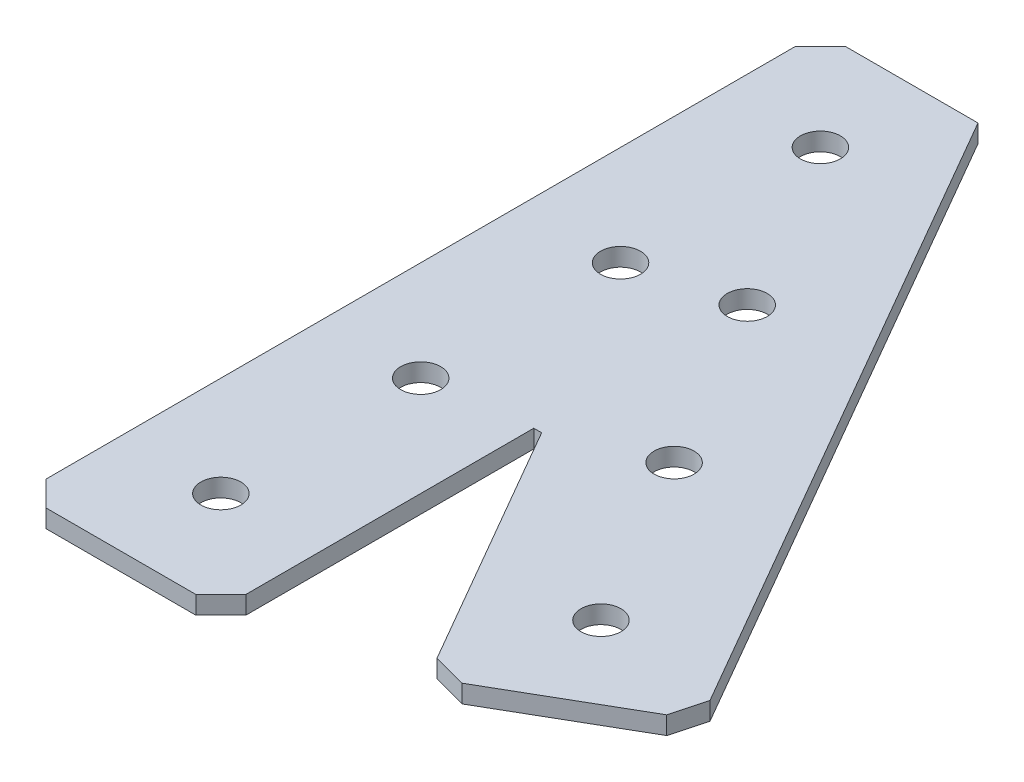
ISO-10303-21;
HEADER;
FILE_DESCRIPTION(('STEP AP214'),'2;1');
FILE_NAME('part.step','',(''),(''),'','','');
FILE_SCHEMA(('AUTOMOTIVE_DESIGN { 1 0 10303 214 1 1 1 1 }'));
ENDSEC;
DATA;
#1=APPLICATION_CONTEXT('core data for automotive mechanical design processes');
#2=APPLICATION_PROTOCOL_DEFINITION('international standard','automotive_design',2000,#1);
#3=PRODUCT_CONTEXT('',#1,'mechanical');
#4=PRODUCT('Part','Part','',(#3));
#5=PRODUCT_RELATED_PRODUCT_CATEGORY('part','',(#4));
#6=PRODUCT_DEFINITION_FORMATION('','',#4);
#7=PRODUCT_DEFINITION_CONTEXT('part definition',#1,'design');
#8=PRODUCT_DEFINITION('design','',#6,#7);
#9=PRODUCT_DEFINITION_SHAPE('','',#8);
#10=(LENGTH_UNIT() NAMED_UNIT(*) SI_UNIT(.MILLI.,.METRE.));
#11=(NAMED_UNIT(*) PLANE_ANGLE_UNIT() SI_UNIT($,.RADIAN.));
#12=(NAMED_UNIT(*) SI_UNIT($,.STERADIAN.) SOLID_ANGLE_UNIT());
#13=UNCERTAINTY_MEASURE_WITH_UNIT(LENGTH_MEASURE(1.E-05),#10,'distance_accuracy_value','');
#14=(GEOMETRIC_REPRESENTATION_CONTEXT(3) GLOBAL_UNCERTAINTY_ASSIGNED_CONTEXT((#13)) GLOBAL_UNIT_ASSIGNED_CONTEXT((#10,
#11,#12)) REPRESENTATION_CONTEXT('',''));
#15=CARTESIAN_POINT('',(0.,0.,0.));
#16=DIRECTION('',(0.,0.,1.));
#17=DIRECTION('',(1.,0.,0.));
#18=AXIS2_PLACEMENT_3D('',#15,#16,#17);
#19=CARTESIAN_POINT('',(13.7,2.286,49.1290960636936));
#20=DIRECTION('',(0.,0.,1.));
#21=DIRECTION('',(1.,0.,0.));
#22=AXIS2_PLACEMENT_3D('',#19,#20,#21);
#23=PLANE('',#22);
#24=DIRECTION('',(1.,0.,0.));
#25=VECTOR('',#24,1.);
#26=CARTESIAN_POINT('',(13.7,2.286,49.1290960636936));
#27=LINE('',#26,#25);
#28=CARTESIAN_POINT('',(13.7,2.286,49.1290960636936));
#29=VERTEX_POINT('',#28);
#30=CARTESIAN_POINT('',(12.7,2.286,49.1290960636936));
#31=VERTEX_POINT('',#30);
#32=EDGE_CURVE('E145',#29,#31,#27,.F.);
#33=ORIENTED_EDGE('',*,*,#32,.T.);
#34=DIRECTION('',(0.,1.,0.));
#35=VECTOR('',#34,1.);
#36=CARTESIAN_POINT('',(12.7,2.286,49.1290960636936));
#37=LINE('',#36,#35);
#38=CARTESIAN_POINT('',(12.7,0.,49.1290960636936));
#39=VERTEX_POINT('',#38);
#40=EDGE_CURVE('E423',#39,#31,#37,.T.);
#41=ORIENTED_EDGE('',*,*,#40,.F.);
#42=DIRECTION('',(1.,0.,0.));
#43=VECTOR('',#42,1.);
#44=CARTESIAN_POINT('',(0.,0.,49.1290960636936));
#45=LINE('',#44,#43);
#46=CARTESIAN_POINT('',(13.7,0.,49.1290960636936));
#47=VERTEX_POINT('',#46);
#48=EDGE_CURVE('E109',#47,#39,#45,.F.);
#49=ORIENTED_EDGE('',*,*,#48,.F.);
#50=DIRECTION('',(0.,1.,0.));
#51=VECTOR('',#50,1.);
#52=CARTESIAN_POINT('',(13.7,2.286,49.1290960636936));
#53=LINE('',#52,#51);
#54=EDGE_CURVE('E121',#29,#47,#53,.F.);
#55=ORIENTED_EDGE('',*,*,#54,.F.);
#56=EDGE_LOOP('',(#33,#41,#49,#55));
#57=FACE_BOUND('',#56,.T.);
#58=ADVANCED_FACE('F18',(#57),#23,.T.);
#59=CARTESIAN_POINT('',(0.,0.,0.));
#60=DIRECTION('',(0.,-1.,0.));
#61=DIRECTION('',(0.,0.,-1.));
#62=AXIS2_PLACEMENT_3D('',#59,#60,#61);
#63=PLANE('',#62);
#64=DIRECTION('',(-0.500000000000001,0.,-0.866025403784438));
#65=VECTOR('',#64,1.);
#66=CARTESIAN_POINT('',(7.33234841870835,0.,-12.7));
#67=LINE('',#66,#65);
#68=CARTESIAN_POINT('',(53.8610226280625,0.,67.8900277394209));
#69=VERTEX_POINT('',#68);
#70=CARTESIAN_POINT('',(7.33234841870834,0.,-12.7));
#71=VERTEX_POINT('',#70);
#72=EDGE_CURVE('E453',#69,#71,#67,.T.);
#73=ORIENTED_EDGE('',*,*,#72,.F.);
#74=DIRECTION('',(0.258819045102514,0.,-0.96592582628907));
#75=VECTOR('',#74,1.);
#76=CARTESIAN_POINT('',(53.8610226280625,0.,67.8900277394209));
#77=LINE('',#76,#75);
#78=CARTESIAN_POINT('',(52.6988919710469,0.,72.2271583964365));
#79=VERTEX_POINT('',#78);
#80=EDGE_CURVE('E449',#79,#69,#77,.T.);
#81=ORIENTED_EDGE('',*,*,#80,.F.);
#82=DIRECTION('',(0.866025403784438,0.,-0.500000000000001));
#83=VECTOR('',#82,1.);
#84=CARTESIAN_POINT('',(52.6988919710469,0.,72.2271583964365));
#85=LINE('',#84,#83);
#86=CARTESIAN_POINT('',(36.2011080289534,0.,81.7521583964365));
#87=VERTEX_POINT('',#86);
#88=EDGE_CURVE('E130',#87,#79,#85,.T.);
#89=ORIENTED_EDGE('',*,*,#88,.F.);
#90=DIRECTION('',(0.965925826289068,0.,0.258819045102521));
#91=VECTOR('',#90,1.);
#92=CARTESIAN_POINT('',(36.2011080289534,0.,81.7521583964365));
#93=LINE('',#92,#91);
#94=CARTESIAN_POINT('',(31.8639773719377,0.,80.5900277394209));
#95=VERTEX_POINT('',#94);
#96=EDGE_CURVE('E123',#95,#87,#93,.T.);
#97=ORIENTED_EDGE('',*,*,#96,.F.);
#98=DIRECTION('',(0.500000000000001,0.,0.866025403784438));
#99=VECTOR('',#98,1.);
#100=CARTESIAN_POINT('',(31.8639773719377,0.,80.5900277394209));
#101=LINE('',#100,#99);
#102=EDGE_CURVE('E114',#47,#95,#101,.T.);
#103=ORIENTED_EDGE('',*,*,#102,.F.);
#104=ORIENTED_EDGE('',*,*,#48,.T.);
#105=DIRECTION('',(0.,0.,-1.));
#106=VECTOR('',#105,1.);
#107=CARTESIAN_POINT('',(12.7,0.,49.1290960636936));
#108=LINE('',#107,#106);
#109=CARTESIAN_POINT('',(12.7,0.,85.725));
#110=VERTEX_POINT('',#109);
#111=EDGE_CURVE('E140',#110,#39,#108,.T.);
#112=ORIENTED_EDGE('',*,*,#111,.F.);
#113=DIRECTION('',(0.707106781186545,0.,-0.70710678118655));
#114=VECTOR('',#113,1.);
#115=CARTESIAN_POINT('',(12.7,0.,85.725));
#116=LINE('',#115,#114);
#117=CARTESIAN_POINT('',(9.525,0.,88.9));
#118=VERTEX_POINT('',#117);
#119=EDGE_CURVE('E430',#118,#110,#116,.T.);
#120=ORIENTED_EDGE('',*,*,#119,.F.);
#121=DIRECTION('',(1.,0.,0.));
#122=VECTOR('',#121,1.);
#123=CARTESIAN_POINT('',(9.525,0.,88.9));
#124=LINE('',#123,#122);
#125=CARTESIAN_POINT('',(-9.52499999999998,0.,88.9));
#126=VERTEX_POINT('',#125);
#127=EDGE_CURVE('E473',#126,#118,#124,.T.);
#128=ORIENTED_EDGE('',*,*,#127,.F.);
#129=DIRECTION('',(0.707106781186544,0.,0.707106781186551));
#130=VECTOR('',#129,1.);
#131=CARTESIAN_POINT('',(-9.52499999999997,0.,88.9));
#132=LINE('',#131,#130);
#133=CARTESIAN_POINT('',(-12.7,0.,85.725));
#134=VERTEX_POINT('',#133);
#135=EDGE_CURVE('E469',#134,#126,#132,.T.);
#136=ORIENTED_EDGE('',*,*,#135,.F.);
#137=DIRECTION('',(0.,0.,1.));
#138=VECTOR('',#137,1.);
#139=CARTESIAN_POINT('',(-12.7,0.,85.725));
#140=LINE('',#139,#138);
#141=CARTESIAN_POINT('',(-12.7,0.,-9.52499999999997));
#142=VERTEX_POINT('',#141);
#143=EDGE_CURVE('E465',#142,#134,#140,.T.);
#144=ORIENTED_EDGE('',*,*,#143,.F.);
#145=DIRECTION('',(-0.707106781186549,0.,0.707106781186546));
#146=VECTOR('',#145,1.);
#147=CARTESIAN_POINT('',(-12.7,0.,-9.52499999999997));
#148=LINE('',#147,#146);
#149=CARTESIAN_POINT('',(-9.52499999999998,0.,-12.7));
#150=VERTEX_POINT('',#149);
#151=EDGE_CURVE('E461',#150,#142,#148,.T.);
#152=ORIENTED_EDGE('',*,*,#151,.F.);
#153=DIRECTION('',(-1.,0.,0.));
#154=VECTOR('',#153,1.);
#155=CARTESIAN_POINT('',(-9.52499999999998,0.,-12.7));
#156=LINE('',#155,#154);
#157=EDGE_CURVE('E457',#71,#150,#156,.T.);
#158=ORIENTED_EDGE('',*,*,#157,.F.);
#159=EDGE_LOOP('',(#73,#81,#89,#97,#103,#104,#112,#120,#128,#136,#144,#152,#158));
#160=FACE_BOUND('',#159,.T.);
#161=CARTESIAN_POINT('',(0.,0.,76.2));
#162=DIRECTION('',(0.,-1.,0.));
#163=DIRECTION('',(0.,0.,-1.));
#164=AXIS2_PLACEMENT_3D('',#161,#162,#163);
#165=CIRCLE('',#164,2.54);
#166=CARTESIAN_POINT('',(0.,0.,73.66));
#167=VERTEX_POINT('',#166);
#168=EDGE_CURVE('E134',#167,#167,#165,.F.);
#169=ORIENTED_EDGE('',*,*,#168,.T.);
#170=EDGE_LOOP('',(#169));
#171=FACE_BOUND('',#170,.T.);
#172=CARTESIAN_POINT('',(0.,0.,50.8));
#173=DIRECTION('',(0.,-1.,0.));
#174=DIRECTION('',(0.,0.,-1.));
#175=AXIS2_PLACEMENT_3D('',#172,#173,#174);
#176=CIRCLE('',#175,2.54);
#177=CARTESIAN_POINT('',(0.,0.,48.26));
#178=VERTEX_POINT('',#177);
#179=EDGE_CURVE('E171',#178,#178,#176,.F.);
#180=ORIENTED_EDGE('',*,*,#179,.T.);
#181=EDGE_LOOP('',(#180));
#182=FACE_BOUND('',#181,.T.);
#183=CARTESIAN_POINT('',(38.1000000000001,0.,65.9911357683742));
#184=DIRECTION('',(0.,-1.,0.));
#185=DIRECTION('',(0.,0.,-1.));
#186=AXIS2_PLACEMENT_3D('',#183,#184,#185);
#187=CIRCLE('',#186,2.54);
#188=CARTESIAN_POINT('',(38.1000000000001,0.,63.4511357683742));
#189=VERTEX_POINT('',#188);
#190=EDGE_CURVE('E174',#189,#189,#187,.F.);
#191=ORIENTED_EDGE('',*,*,#190,.T.);
#192=EDGE_LOOP('',(#191));
#193=FACE_BOUND('',#192,.T.);
#194=CARTESIAN_POINT('',(25.4000000000001,0.,43.9940905122494));
#195=DIRECTION('',(0.,-1.,0.));
#196=DIRECTION('',(0.,0.,-1.));
#197=AXIS2_PLACEMENT_3D('',#194,#195,#196);
#198=CIRCLE('',#197,2.54);
#199=CARTESIAN_POINT('',(25.4000000000001,0.,41.4540905122495));
#200=VERTEX_POINT('',#199);
#201=EDGE_CURVE('E177',#200,#200,#198,.F.);
#202=ORIENTED_EDGE('',*,*,#201,.T.);
#203=EDGE_LOOP('',(#202));
#204=FACE_BOUND('',#203,.T.);
#205=CARTESIAN_POINT('',(0.,0.,0.));
#206=DIRECTION('',(0.,-1.,0.));
#207=DIRECTION('',(0.,0.,-1.));
#208=AXIS2_PLACEMENT_3D('',#205,#206,#207);
#209=CIRCLE('',#208,2.54);
#210=CARTESIAN_POINT('',(0.,0.,-2.53999999999999));
#211=VERTEX_POINT('',#210);
#212=EDGE_CURVE('E180',#211,#211,#209,.F.);
#213=ORIENTED_EDGE('',*,*,#212,.T.);
#214=EDGE_LOOP('',(#213));
#215=FACE_BOUND('',#214,.T.);
#216=CARTESIAN_POINT('',(12.7,0.,21.9970452561247));
#217=DIRECTION('',(0.,-1.,0.));
#218=DIRECTION('',(0.,0.,-1.));
#219=AXIS2_PLACEMENT_3D('',#216,#217,#218);
#220=CIRCLE('',#219,2.54);
#221=CARTESIAN_POINT('',(12.7,0.,19.4570452561247));
#222=VERTEX_POINT('',#221);
#223=EDGE_CURVE('E182',#222,#222,#220,.F.);
#224=ORIENTED_EDGE('',*,*,#223,.T.);
#225=EDGE_LOOP('',(#224));
#226=FACE_BOUND('',#225,.T.);
#227=CARTESIAN_POINT('',(0.,0.,25.4));
#228=DIRECTION('',(0.,-1.,0.));
#229=DIRECTION('',(0.,0.,-1.));
#230=AXIS2_PLACEMENT_3D('',#227,#228,#229);
#231=CIRCLE('',#230,2.54);
#232=CARTESIAN_POINT('',(0.,0.,22.86));
#233=VERTEX_POINT('',#232);
#234=EDGE_CURVE('E21',#233,#233,#231,.F.);
#235=ORIENTED_EDGE('',*,*,#234,.T.);
#236=EDGE_LOOP('',(#235));
#237=FACE_BOUND('',#236,.T.);
#238=ADVANCED_FACE('F127',(#160,#171,#182,#193,#204,#215,#226,#237),#63,.T.);
#239=CARTESIAN_POINT('',(0.,2.286,25.4));
#240=DIRECTION('',(0.,-1.,0.));
#241=DIRECTION('',(0.,0.,-1.));
#242=AXIS2_PLACEMENT_3D('',#239,#240,#241);
#243=CYLINDRICAL_SURFACE('',#242,2.54);
#244=CARTESIAN_POINT('',(0.,2.286,25.4));
#245=DIRECTION('',(0.,-1.,0.));
#246=DIRECTION('',(0.,0.,-1.));
#247=AXIS2_PLACEMENT_3D('',#244,#245,#246);
#248=CIRCLE('',#247,2.54);
#249=CARTESIAN_POINT('',(0.,2.286,22.86));
#250=VERTEX_POINT('',#249);
#251=EDGE_CURVE('E165',#250,#250,#248,.F.);
#252=ORIENTED_EDGE('',*,*,#251,.T.);
#253=EDGE_LOOP('',(#252));
#254=FACE_BOUND('',#253,.T.);
#255=ORIENTED_EDGE('',*,*,#234,.F.);
#256=EDGE_LOOP('',(#255));
#257=FACE_BOUND('',#256,.T.);
#258=ADVANCED_FACE('F190',(#254,#257),#243,.F.);
#259=CARTESIAN_POINT('',(12.7,2.286,21.9970452561247));
#260=DIRECTION('',(0.,-1.,0.));
#261=DIRECTION('',(0.,0.,-1.));
#262=AXIS2_PLACEMENT_3D('',#259,#260,#261);
#263=CYLINDRICAL_SURFACE('',#262,2.54);
#264=CARTESIAN_POINT('',(12.7,2.286,21.9970452561247));
#265=DIRECTION('',(0.,-1.,0.));
#266=DIRECTION('',(0.,0.,-1.));
#267=AXIS2_PLACEMENT_3D('',#264,#265,#266);
#268=CIRCLE('',#267,2.54);
#269=CARTESIAN_POINT('',(12.7,2.286,19.4570452561247));
#270=VERTEX_POINT('',#269);
#271=EDGE_CURVE('E162',#270,#270,#268,.F.);
#272=ORIENTED_EDGE('',*,*,#271,.T.);
#273=EDGE_LOOP('',(#272));
#274=FACE_BOUND('',#273,.T.);
#275=ORIENTED_EDGE('',*,*,#223,.F.);
#276=EDGE_LOOP('',(#275));
#277=FACE_BOUND('',#276,.T.);
#278=ADVANCED_FACE('F192',(#274,#277),#263,.F.);
#279=CARTESIAN_POINT('',(0.,2.286,0.));
#280=DIRECTION('',(0.,-1.,0.));
#281=DIRECTION('',(0.,0.,-1.));
#282=AXIS2_PLACEMENT_3D('',#279,#280,#281);
#283=CYLINDRICAL_SURFACE('',#282,2.54);
#284=CARTESIAN_POINT('',(0.,2.286,0.));
#285=DIRECTION('',(0.,-1.,0.));
#286=DIRECTION('',(0.,0.,-1.));
#287=AXIS2_PLACEMENT_3D('',#284,#285,#286);
#288=CIRCLE('',#287,2.54);
#289=CARTESIAN_POINT('',(0.,2.286,-2.53999999999999));
#290=VERTEX_POINT('',#289);
#291=EDGE_CURVE('E159',#290,#290,#288,.F.);
#292=ORIENTED_EDGE('',*,*,#291,.T.);
#293=EDGE_LOOP('',(#292));
#294=FACE_BOUND('',#293,.T.);
#295=ORIENTED_EDGE('',*,*,#212,.F.);
#296=EDGE_LOOP('',(#295));
#297=FACE_BOUND('',#296,.T.);
#298=ADVANCED_FACE('F200',(#294,#297),#283,.F.);
#299=CARTESIAN_POINT('',(25.4000000000001,2.286,43.9940905122494));
#300=DIRECTION('',(0.,-1.,0.));
#301=DIRECTION('',(0.,0.,-1.));
#302=AXIS2_PLACEMENT_3D('',#299,#300,#301);
#303=CYLINDRICAL_SURFACE('',#302,2.54);
#304=CARTESIAN_POINT('',(25.4000000000001,2.286,43.9940905122494));
#305=DIRECTION('',(0.,-1.,0.));
#306=DIRECTION('',(0.,0.,-1.));
#307=AXIS2_PLACEMENT_3D('',#304,#305,#306);
#308=CIRCLE('',#307,2.54);
#309=CARTESIAN_POINT('',(25.4000000000001,2.286,41.4540905122495));
#310=VERTEX_POINT('',#309);
#311=EDGE_CURVE('E156',#310,#310,#308,.F.);
#312=ORIENTED_EDGE('',*,*,#311,.T.);
#313=EDGE_LOOP('',(#312));
#314=FACE_BOUND('',#313,.T.);
#315=ORIENTED_EDGE('',*,*,#201,.F.);
#316=EDGE_LOOP('',(#315));
#317=FACE_BOUND('',#316,.T.);
#318=ADVANCED_FACE('F266',(#314,#317),#303,.F.);
#319=CARTESIAN_POINT('',(38.1000000000001,2.286,65.9911357683742));
#320=DIRECTION('',(0.,-1.,0.));
#321=DIRECTION('',(0.,0.,-1.));
#322=AXIS2_PLACEMENT_3D('',#319,#320,#321);
#323=CYLINDRICAL_SURFACE('',#322,2.54);
#324=CARTESIAN_POINT('',(38.1000000000001,2.286,65.9911357683742));
#325=DIRECTION('',(0.,-1.,0.));
#326=DIRECTION('',(0.,0.,-1.));
#327=AXIS2_PLACEMENT_3D('',#324,#325,#326);
#328=CIRCLE('',#327,2.54);
#329=CARTESIAN_POINT('',(38.1000000000001,2.286,63.4511357683742));
#330=VERTEX_POINT('',#329);
#331=EDGE_CURVE('E153',#330,#330,#328,.F.);
#332=ORIENTED_EDGE('',*,*,#331,.T.);
#333=EDGE_LOOP('',(#332));
#334=FACE_BOUND('',#333,.T.);
#335=ORIENTED_EDGE('',*,*,#190,.F.);
#336=EDGE_LOOP('',(#335));
#337=FACE_BOUND('',#336,.T.);
#338=ADVANCED_FACE('F262',(#334,#337),#323,.F.);
#339=CARTESIAN_POINT('',(0.,2.286,50.8));
#340=DIRECTION('',(0.,-1.,0.));
#341=DIRECTION('',(0.,0.,-1.));
#342=AXIS2_PLACEMENT_3D('',#339,#340,#341);
#343=CYLINDRICAL_SURFACE('',#342,2.54);
#344=CARTESIAN_POINT('',(0.,2.286,50.8));
#345=DIRECTION('',(0.,-1.,0.));
#346=DIRECTION('',(0.,0.,-1.));
#347=AXIS2_PLACEMENT_3D('',#344,#345,#346);
#348=CIRCLE('',#347,2.54);
#349=CARTESIAN_POINT('',(0.,2.286,48.26));
#350=VERTEX_POINT('',#349);
#351=EDGE_CURVE('E150',#350,#350,#348,.F.);
#352=ORIENTED_EDGE('',*,*,#351,.T.);
#353=EDGE_LOOP('',(#352));
#354=FACE_BOUND('',#353,.T.);
#355=ORIENTED_EDGE('',*,*,#179,.F.);
#356=EDGE_LOOP('',(#355));
#357=FACE_BOUND('',#356,.T.);
#358=ADVANCED_FACE('F258',(#354,#357),#343,.F.);
#359=CARTESIAN_POINT('',(0.,2.286,76.2));
#360=DIRECTION('',(0.,-1.,0.));
#361=DIRECTION('',(0.,0.,-1.));
#362=AXIS2_PLACEMENT_3D('',#359,#360,#361);
#363=CYLINDRICAL_SURFACE('',#362,2.54);
#364=CARTESIAN_POINT('',(0.,2.286,76.2));
#365=DIRECTION('',(0.,-1.,0.));
#366=DIRECTION('',(0.,0.,-1.));
#367=AXIS2_PLACEMENT_3D('',#364,#365,#366);
#368=CIRCLE('',#367,2.54);
#369=CARTESIAN_POINT('',(0.,2.286,73.66));
#370=VERTEX_POINT('',#369);
#371=EDGE_CURVE('E147',#370,#370,#368,.F.);
#372=ORIENTED_EDGE('',*,*,#371,.T.);
#373=EDGE_LOOP('',(#372));
#374=FACE_BOUND('',#373,.T.);
#375=ORIENTED_EDGE('',*,*,#168,.F.);
#376=EDGE_LOOP('',(#375));
#377=FACE_BOUND('',#376,.T.);
#378=ADVANCED_FACE('F255',(#374,#377),#363,.F.);
#379=CARTESIAN_POINT('',(36.2011080289534,2.286,81.7521583964365));
#380=DIRECTION('',(-0.258819045102521,0.,0.965925826289068));
#381=DIRECTION('',(0.965925826289068,0.,0.258819045102521));
#382=AXIS2_PLACEMENT_3D('',#379,#380,#381);
#383=PLANE('',#382);
#384=DIRECTION('',(-0.965925826289068,0.,-0.258819045102521));
#385=VECTOR('',#384,1.);
#386=CARTESIAN_POINT('',(36.2011080289534,2.286,81.7521583964365));
#387=LINE('',#386,#385);
#388=CARTESIAN_POINT('',(36.2011080289534,2.286,81.7521583964365));
#389=VERTEX_POINT('',#388);
#390=CARTESIAN_POINT('',(31.8639773719377,2.286,80.5900277394209));
#391=VERTEX_POINT('',#390);
#392=EDGE_CURVE('E138',#389,#391,#387,.T.);
#393=ORIENTED_EDGE('',*,*,#392,.T.);
#394=DIRECTION('',(0.,1.,0.));
#395=VECTOR('',#394,1.);
#396=CARTESIAN_POINT('',(31.8639773719377,2.286,80.5900277394209));
#397=LINE('',#396,#395);
#398=EDGE_CURVE('E119',#95,#391,#397,.T.);
#399=ORIENTED_EDGE('',*,*,#398,.F.);
#400=ORIENTED_EDGE('',*,*,#96,.T.);
#401=DIRECTION('',(0.,1.,0.));
#402=VECTOR('',#401,1.);
#403=CARTESIAN_POINT('',(36.2011080289534,2.286,81.7521583964365));
#404=LINE('',#403,#402);
#405=EDGE_CURVE('E168',#389,#87,#404,.F.);
#406=ORIENTED_EDGE('',*,*,#405,.F.);
#407=EDGE_LOOP('',(#393,#399,#400,#406));
#408=FACE_BOUND('',#407,.T.);
#409=ADVANCED_FACE('F137',(#408),#383,.T.);
#410=CARTESIAN_POINT('',(31.8639773719377,2.286,80.5900277394209));
#411=DIRECTION('',(-0.866025403784438,0.,0.500000000000001));
#412=DIRECTION('',(0.500000000000001,0.,0.866025403784438));
#413=AXIS2_PLACEMENT_3D('',#410,#411,#412);
#414=PLANE('',#413);
#415=DIRECTION('',(-0.500000000000001,0.,-0.866025403784438));
#416=VECTOR('',#415,1.);
#417=CARTESIAN_POINT('',(31.8639773719377,2.286,80.5900277394209));
#418=LINE('',#417,#416);
#419=EDGE_CURVE('E436',#391,#29,#418,.T.);
#420=ORIENTED_EDGE('',*,*,#419,.T.);
#421=ORIENTED_EDGE('',*,*,#54,.T.);
#422=ORIENTED_EDGE('',*,*,#102,.T.);
#423=ORIENTED_EDGE('',*,*,#398,.T.);
#424=EDGE_LOOP('',(#420,#421,#422,#423));
#425=FACE_BOUND('',#424,.T.);
#426=ADVANCED_FACE('F117',(#425),#414,.T.);
#427=CARTESIAN_POINT('',(12.7,2.286,49.1290960636936));
#428=DIRECTION('',(1.,0.,0.));
#429=DIRECTION('',(0.,0.,-1.));
#430=AXIS2_PLACEMENT_3D('',#427,#428,#429);
#431=PLANE('',#430);
#432=DIRECTION('',(0.,0.,-1.));
#433=VECTOR('',#432,1.);
#434=CARTESIAN_POINT('',(12.7,2.286,0.));
#435=LINE('',#434,#433);
#436=CARTESIAN_POINT('',(12.7,2.286,85.725));
#437=VERTEX_POINT('',#436);
#438=EDGE_CURVE('E428',#31,#437,#435,.F.);
#439=ORIENTED_EDGE('',*,*,#438,.T.);
#440=DIRECTION('',(0.,1.,0.));
#441=VECTOR('',#440,1.);
#442=CARTESIAN_POINT('',(12.7,2.286,85.725));
#443=LINE('',#442,#441);
#444=EDGE_CURVE('E475',#110,#437,#443,.T.);
#445=ORIENTED_EDGE('',*,*,#444,.F.);
#446=ORIENTED_EDGE('',*,*,#111,.T.);
#447=ORIENTED_EDGE('',*,*,#40,.T.);
#448=EDGE_LOOP('',(#439,#445,#446,#447));
#449=FACE_BOUND('',#448,.T.);
#450=ADVANCED_FACE('F246',(#449),#431,.T.);
#451=CARTESIAN_POINT('',(12.7,2.286,85.725));
#452=DIRECTION('',(0.70710678118655,0.,0.707106781186545));
#453=DIRECTION('',(0.707106781186545,0.,-0.70710678118655));
#454=AXIS2_PLACEMENT_3D('',#451,#452,#453);
#455=PLANE('',#454);
#456=DIRECTION('',(-0.707106781186545,0.,0.707106781186551));
#457=VECTOR('',#456,1.);
#458=CARTESIAN_POINT('',(12.7,2.286,85.725));
#459=LINE('',#458,#457);
#460=CARTESIAN_POINT('',(9.525,2.286,88.9));
#461=VERTEX_POINT('',#460);
#462=EDGE_CURVE('E435',#437,#461,#459,.T.);
#463=ORIENTED_EDGE('',*,*,#462,.T.);
#464=DIRECTION('',(0.,1.,0.));
#465=VECTOR('',#464,1.);
#466=CARTESIAN_POINT('',(9.525,2.286,88.9));
#467=LINE('',#466,#465);
#468=EDGE_CURVE('E471',#118,#461,#467,.T.);
#469=ORIENTED_EDGE('',*,*,#468,.F.);
#470=ORIENTED_EDGE('',*,*,#119,.T.);
#471=ORIENTED_EDGE('',*,*,#444,.T.);
#472=EDGE_LOOP('',(#463,#469,#470,#471));
#473=FACE_BOUND('',#472,.T.);
#474=ADVANCED_FACE('F242',(#473),#455,.T.);
#475=CARTESIAN_POINT('',(9.525,2.286,88.9));
#476=DIRECTION('',(0.,0.,1.));
#477=DIRECTION('',(1.,0.,0.));
#478=AXIS2_PLACEMENT_3D('',#475,#476,#477);
#479=PLANE('',#478);
#480=DIRECTION('',(1.,0.,0.));
#481=VECTOR('',#480,1.);
#482=CARTESIAN_POINT('',(0.,2.286,88.9));
#483=LINE('',#482,#481);
#484=CARTESIAN_POINT('',(-9.52499999999998,2.286,88.9));
#485=VERTEX_POINT('',#484);
#486=EDGE_CURVE('E438',#461,#485,#483,.F.);
#487=ORIENTED_EDGE('',*,*,#486,.T.);
#488=DIRECTION('',(0.,1.,0.));
#489=VECTOR('',#488,1.);
#490=CARTESIAN_POINT('',(-9.52499999999997,2.286,88.9));
#491=LINE('',#490,#489);
#492=EDGE_CURVE('E467',#126,#485,#491,.T.);
#493=ORIENTED_EDGE('',*,*,#492,.F.);
#494=ORIENTED_EDGE('',*,*,#127,.T.);
#495=ORIENTED_EDGE('',*,*,#468,.T.);
#496=EDGE_LOOP('',(#487,#493,#494,#495));
#497=FACE_BOUND('',#496,.T.);
#498=ADVANCED_FACE('F238',(#497),#479,.T.);
#499=CARTESIAN_POINT('',(-9.52499999999997,2.286,88.9));
#500=DIRECTION('',(-0.707106781186551,0.,0.707106781186544));
#501=DIRECTION('',(0.707106781186544,0.,0.707106781186551));
#502=AXIS2_PLACEMENT_3D('',#499,#500,#501);
#503=PLANE('',#502);
#504=DIRECTION('',(-0.707106781186543,0.,-0.707106781186552));
#505=VECTOR('',#504,1.);
#506=CARTESIAN_POINT('',(-9.52499999999997,2.286,88.9));
#507=LINE('',#506,#505);
#508=CARTESIAN_POINT('',(-12.7,2.286,85.725));
#509=VERTEX_POINT('',#508);
#510=EDGE_CURVE('E487',#485,#509,#507,.T.);
#511=ORIENTED_EDGE('',*,*,#510,.T.);
#512=DIRECTION('',(0.,1.,0.));
#513=VECTOR('',#512,1.);
#514=CARTESIAN_POINT('',(-12.7,2.286,85.725));
#515=LINE('',#514,#513);
#516=EDGE_CURVE('E463',#134,#509,#515,.T.);
#517=ORIENTED_EDGE('',*,*,#516,.F.);
#518=ORIENTED_EDGE('',*,*,#135,.T.);
#519=ORIENTED_EDGE('',*,*,#492,.T.);
#520=EDGE_LOOP('',(#511,#517,#518,#519));
#521=FACE_BOUND('',#520,.T.);
#522=ADVANCED_FACE('F234',(#521),#503,.T.);
#523=CARTESIAN_POINT('',(-12.7,2.286,85.725));
#524=DIRECTION('',(-1.,0.,0.));
#525=DIRECTION('',(0.,0.,1.));
#526=AXIS2_PLACEMENT_3D('',#523,#524,#525);
#527=PLANE('',#526);
#528=DIRECTION('',(0.,0.,-1.));
#529=VECTOR('',#528,1.);
#530=CARTESIAN_POINT('',(-12.7,2.286,0.));
#531=LINE('',#530,#529);
#532=CARTESIAN_POINT('',(-12.7,2.286,-9.52499999999997));
#533=VERTEX_POINT('',#532);
#534=EDGE_CURVE('E491',#509,#533,#531,.T.);
#535=ORIENTED_EDGE('',*,*,#534,.T.);
#536=DIRECTION('',(0.,1.,0.));
#537=VECTOR('',#536,1.);
#538=CARTESIAN_POINT('',(-12.7,2.286,-9.52499999999997));
#539=LINE('',#538,#537);
#540=EDGE_CURVE('E459',#142,#533,#539,.T.);
#541=ORIENTED_EDGE('',*,*,#540,.F.);
#542=ORIENTED_EDGE('',*,*,#143,.T.);
#543=ORIENTED_EDGE('',*,*,#516,.T.);
#544=EDGE_LOOP('',(#535,#541,#542,#543));
#545=FACE_BOUND('',#544,.T.);
#546=ADVANCED_FACE('F230',(#545),#527,.T.);
#547=CARTESIAN_POINT('',(-12.7,2.286,-9.52499999999997));
#548=DIRECTION('',(-0.707106781186546,0.,-0.707106781186549));
#549=DIRECTION('',(-0.707106781186549,0.,0.707106781186546));
#550=AXIS2_PLACEMENT_3D('',#547,#548,#549);
#551=PLANE('',#550);
#552=DIRECTION('',(0.707106781186549,0.,-0.707106781186546));
#553=VECTOR('',#552,1.);
#554=CARTESIAN_POINT('',(-12.7,2.286,-9.52499999999997));
#555=LINE('',#554,#553);
#556=CARTESIAN_POINT('',(-9.52499999999998,2.286,-12.7));
#557=VERTEX_POINT('',#556);
#558=EDGE_CURVE('E493',#533,#557,#555,.T.);
#559=ORIENTED_EDGE('',*,*,#558,.T.);
#560=DIRECTION('',(0.,1.,0.));
#561=VECTOR('',#560,1.);
#562=CARTESIAN_POINT('',(-9.52499999999998,2.286,-12.7));
#563=LINE('',#562,#561);
#564=EDGE_CURVE('E455',#150,#557,#563,.T.);
#565=ORIENTED_EDGE('',*,*,#564,.F.);
#566=ORIENTED_EDGE('',*,*,#151,.T.);
#567=ORIENTED_EDGE('',*,*,#540,.T.);
#568=EDGE_LOOP('',(#559,#565,#566,#567));
#569=FACE_BOUND('',#568,.T.);
#570=ADVANCED_FACE('F226',(#569),#551,.T.);
#571=CARTESIAN_POINT('',(-9.52499999999998,2.286,-12.7));
#572=DIRECTION('',(0.,0.,-1.));
#573=DIRECTION('',(-1.,0.,0.));
#574=AXIS2_PLACEMENT_3D('',#571,#572,#573);
#575=PLANE('',#574);
#576=DIRECTION('',(1.,0.,0.));
#577=VECTOR('',#576,1.);
#578=CARTESIAN_POINT('',(0.,2.286,-12.7));
#579=LINE('',#578,#577);
#580=CARTESIAN_POINT('',(7.33234841870835,2.286,-12.7));
#581=VERTEX_POINT('',#580);
#582=EDGE_CURVE('E498',#557,#581,#579,.T.);
#583=ORIENTED_EDGE('',*,*,#582,.T.);
#584=DIRECTION('',(0.,1.,0.));
#585=VECTOR('',#584,1.);
#586=CARTESIAN_POINT('',(7.33234841870835,2.286,-12.7));
#587=LINE('',#586,#585);
#588=EDGE_CURVE('E451',#71,#581,#587,.T.);
#589=ORIENTED_EDGE('',*,*,#588,.F.);
#590=ORIENTED_EDGE('',*,*,#157,.T.);
#591=ORIENTED_EDGE('',*,*,#564,.T.);
#592=EDGE_LOOP('',(#583,#589,#590,#591));
#593=FACE_BOUND('',#592,.T.);
#594=ADVANCED_FACE('F222',(#593),#575,.T.);
#595=CARTESIAN_POINT('',(7.33234841870835,2.286,-12.7));
#596=DIRECTION('',(0.866025403784438,0.,-0.500000000000001));
#597=DIRECTION('',(-0.500000000000001,0.,-0.866025403784438));
#598=AXIS2_PLACEMENT_3D('',#595,#596,#597);
#599=PLANE('',#598);
#600=DIRECTION('',(0.500000000000001,0.,0.866025403784438));
#601=VECTOR('',#600,1.);
#602=CARTESIAN_POINT('',(7.33234841870835,2.286,-12.7));
#603=LINE('',#602,#601);
#604=CARTESIAN_POINT('',(53.8610226280625,2.286,67.8900277394209));
#605=VERTEX_POINT('',#604);
#606=EDGE_CURVE('E501',#581,#605,#603,.T.);
#607=ORIENTED_EDGE('',*,*,#606,.T.);
#608=DIRECTION('',(0.,1.,0.));
#609=VECTOR('',#608,1.);
#610=CARTESIAN_POINT('',(53.8610226280625,2.286,67.8900277394209));
#611=LINE('',#610,#609);
#612=EDGE_CURVE('E447',#69,#605,#611,.T.);
#613=ORIENTED_EDGE('',*,*,#612,.F.);
#614=ORIENTED_EDGE('',*,*,#72,.T.);
#615=ORIENTED_EDGE('',*,*,#588,.T.);
#616=EDGE_LOOP('',(#607,#613,#614,#615));
#617=FACE_BOUND('',#616,.T.);
#618=ADVANCED_FACE('F218',(#617),#599,.T.);
#619=CARTESIAN_POINT('',(53.8610226280625,2.286,67.8900277394209));
#620=DIRECTION('',(0.96592582628907,0.,0.258819045102514));
#621=DIRECTION('',(0.258819045102514,0.,-0.96592582628907));
#622=AXIS2_PLACEMENT_3D('',#619,#620,#621);
#623=PLANE('',#622);
#624=DIRECTION('',(-0.258819045102516,0.,0.96592582628907));
#625=VECTOR('',#624,1.);
#626=CARTESIAN_POINT('',(53.8610226280625,2.286,67.8900277394209));
#627=LINE('',#626,#625);
#628=CARTESIAN_POINT('',(52.6988919710469,2.286,72.2271583964365));
#629=VERTEX_POINT('',#628);
#630=EDGE_CURVE('E27',#605,#629,#627,.T.);
#631=ORIENTED_EDGE('',*,*,#630,.T.);
#632=DIRECTION('',(0.,1.,0.));
#633=VECTOR('',#632,1.);
#634=CARTESIAN_POINT('',(52.6988919710469,2.286,72.2271583964365));
#635=LINE('',#634,#633);
#636=EDGE_CURVE('E35',#79,#629,#635,.T.);
#637=ORIENTED_EDGE('',*,*,#636,.F.);
#638=ORIENTED_EDGE('',*,*,#80,.T.);
#639=ORIENTED_EDGE('',*,*,#612,.T.);
#640=EDGE_LOOP('',(#631,#637,#638,#639));
#641=FACE_BOUND('',#640,.T.);
#642=ADVANCED_FACE('F211',(#641),#623,.T.);
#643=CARTESIAN_POINT('',(52.6988919710469,2.286,72.2271583964365));
#644=DIRECTION('',(0.500000000000001,0.,0.866025403784438));
#645=DIRECTION('',(0.866025403784438,0.,-0.500000000000001));
#646=AXIS2_PLACEMENT_3D('',#643,#644,#645);
#647=PLANE('',#646);
#648=DIRECTION('',(-0.866025403784438,0.,0.500000000000001));
#649=VECTOR('',#648,1.);
#650=CARTESIAN_POINT('',(52.6988919710469,2.286,72.2271583964365));
#651=LINE('',#650,#649);
#652=EDGE_CURVE('E11',#629,#389,#651,.T.);
#653=ORIENTED_EDGE('',*,*,#652,.T.);
#654=ORIENTED_EDGE('',*,*,#405,.T.);
#655=ORIENTED_EDGE('',*,*,#88,.T.);
#656=ORIENTED_EDGE('',*,*,#636,.T.);
#657=EDGE_LOOP('',(#653,#654,#655,#656));
#658=FACE_BOUND('',#657,.T.);
#659=ADVANCED_FACE('F205',(#658),#647,.T.);
#660=CARTESIAN_POINT('',(0.,2.286,0.));
#661=DIRECTION('',(0.,-1.,0.));
#662=DIRECTION('',(0.,0.,-1.));
#663=AXIS2_PLACEMENT_3D('',#660,#661,#662);
#664=PLANE('',#663);
#665=ORIENTED_EDGE('',*,*,#630,.F.);
#666=ORIENTED_EDGE('',*,*,#606,.F.);
#667=ORIENTED_EDGE('',*,*,#582,.F.);
#668=ORIENTED_EDGE('',*,*,#558,.F.);
#669=ORIENTED_EDGE('',*,*,#534,.F.);
#670=ORIENTED_EDGE('',*,*,#510,.F.);
#671=ORIENTED_EDGE('',*,*,#486,.F.);
#672=ORIENTED_EDGE('',*,*,#462,.F.);
#673=ORIENTED_EDGE('',*,*,#438,.F.);
#674=ORIENTED_EDGE('',*,*,#32,.F.);
#675=ORIENTED_EDGE('',*,*,#419,.F.);
#676=ORIENTED_EDGE('',*,*,#392,.F.);
#677=ORIENTED_EDGE('',*,*,#652,.F.);
#678=EDGE_LOOP('',(#665,#666,#667,#668,#669,#670,#671,#672,#673,#674,#675,#676,#677));
#679=FACE_BOUND('',#678,.T.);
#680=ORIENTED_EDGE('',*,*,#371,.F.);
#681=EDGE_LOOP('',(#680));
#682=FACE_BOUND('',#681,.T.);
#683=ORIENTED_EDGE('',*,*,#351,.F.);
#684=EDGE_LOOP('',(#683));
#685=FACE_BOUND('',#684,.T.);
#686=ORIENTED_EDGE('',*,*,#331,.F.);
#687=EDGE_LOOP('',(#686));
#688=FACE_BOUND('',#687,.T.);
#689=ORIENTED_EDGE('',*,*,#311,.F.);
#690=EDGE_LOOP('',(#689));
#691=FACE_BOUND('',#690,.T.);
#692=ORIENTED_EDGE('',*,*,#291,.F.);
#693=EDGE_LOOP('',(#692));
#694=FACE_BOUND('',#693,.T.);
#695=ORIENTED_EDGE('',*,*,#271,.F.);
#696=EDGE_LOOP('',(#695));
#697=FACE_BOUND('',#696,.T.);
#698=ORIENTED_EDGE('',*,*,#251,.F.);
#699=EDGE_LOOP('',(#698));
#700=FACE_BOUND('',#699,.T.);
#701=ADVANCED_FACE('F203',(#679,#682,#685,#688,#691,#694,#697,#700),#664,.F.);
#702=CLOSED_SHELL('',(#58,#238,#258,#278,#298,#318,#338,#358,#378,#409,#426,#450,#474,#498,#522,
#546,#570,#594,#618,#642,#659,#701));
#703=MANIFOLD_SOLID_BREP('B1',#702);
#704=ADVANCED_BREP_SHAPE_REPRESENTATION('',(#18,#703),#14);
#705=SHAPE_DEFINITION_REPRESENTATION(#9,#704);
ENDSEC;
END-ISO-10303-21;
